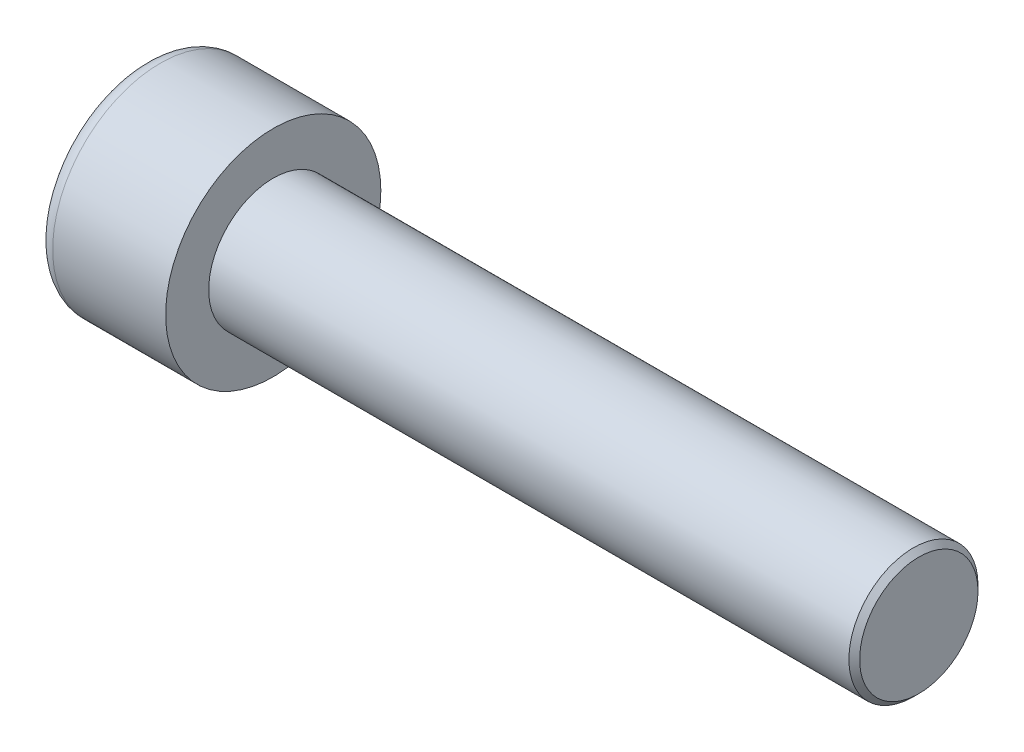
ISO-10303-21;
HEADER;
FILE_DESCRIPTION(('STEP AP214'),'2;1');
FILE_NAME('part.step','',(''),(''),'','','');
FILE_SCHEMA(('AUTOMOTIVE_DESIGN { 1 0 10303 214 1 1 1 1 }'));
ENDSEC;
DATA;
#1=APPLICATION_CONTEXT('core data for automotive mechanical design processes');
#2=APPLICATION_PROTOCOL_DEFINITION('international standard','automotive_design',2000,#1);
#3=PRODUCT_CONTEXT('',#1,'mechanical');
#4=PRODUCT('Part','Part','',(#3));
#5=PRODUCT_RELATED_PRODUCT_CATEGORY('part','',(#4));
#6=PRODUCT_DEFINITION_FORMATION('','',#4);
#7=PRODUCT_DEFINITION_CONTEXT('part definition',#1,'design');
#8=PRODUCT_DEFINITION('design','',#6,#7);
#9=PRODUCT_DEFINITION_SHAPE('','',#8);
#10=(LENGTH_UNIT() NAMED_UNIT(*) SI_UNIT(.MILLI.,.METRE.));
#11=(NAMED_UNIT(*) PLANE_ANGLE_UNIT() SI_UNIT($,.RADIAN.));
#12=(NAMED_UNIT(*) SI_UNIT($,.STERADIAN.) SOLID_ANGLE_UNIT());
#13=UNCERTAINTY_MEASURE_WITH_UNIT(LENGTH_MEASURE(1.E-05),#10,'distance_accuracy_value','');
#14=(GEOMETRIC_REPRESENTATION_CONTEXT(3) GLOBAL_UNCERTAINTY_ASSIGNED_CONTEXT((#13)) GLOBAL_UNIT_ASSIGNED_CONTEXT((#10,
#11,#12)) REPRESENTATION_CONTEXT('',''));
#15=CARTESIAN_POINT('',(0.,0.,0.));
#16=DIRECTION('',(0.,0.,1.));
#17=DIRECTION('',(1.,0.,0.));
#18=AXIS2_PLACEMENT_3D('',#15,#16,#17);
#19=CARTESIAN_POINT('',(3.,0.,-2.88675134594813));
#20=DIRECTION('',(1.,0.,0.));
#21=DIRECTION('',(0.,0.,-1.));
#22=AXIS2_PLACEMENT_3D('',#19,#20,#21);
#23=PLANE('',#22);
#24=CARTESIAN_POINT('',(3.,0.,0.));
#25=DIRECTION('',(1.,0.,0.));
#26=DIRECTION('',(0.,0.,-1.));
#27=AXIS2_PLACEMENT_3D('',#24,#25,#26);
#28=CIRCLE('',#27,2.5);
#29=CARTESIAN_POINT('',(3.,-1.25,-2.1650635094611));
#30=VERTEX_POINT('',#29);
#31=CARTESIAN_POINT('',(3.,-2.5,0.));
#32=VERTEX_POINT('',#31);
#33=EDGE_CURVE('E160',#30,#32,#28,.F.);
#34=ORIENTED_EDGE('',*,*,#33,.F.);
#35=DIRECTION('',(0.,0.866025403784439,-0.5));
#36=VECTOR('',#35,1.);
#37=CARTESIAN_POINT('',(3.,-2.5,-1.44337567297407));
#38=LINE('',#37,#36);
#39=CARTESIAN_POINT('',(3.,-2.5,-1.44337567297407));
#40=VERTEX_POINT('',#39);
#41=EDGE_CURVE('E168',#40,#30,#38,.T.);
#42=ORIENTED_EDGE('',*,*,#41,.F.);
#43=DIRECTION('',(0.,0.,-1.));
#44=VECTOR('',#43,1.);
#45=CARTESIAN_POINT('',(3.,-2.5,1.44337567297406));
#46=LINE('',#45,#44);
#47=EDGE_CURVE('E185',#32,#40,#46,.T.);
#48=ORIENTED_EDGE('',*,*,#47,.F.);
#49=EDGE_LOOP('',(#34,#42,#48));
#50=FACE_BOUND('',#49,.T.);
#51=ADVANCED_FACE('F37',(#50),#23,.F.);
#52=CARTESIAN_POINT('',(3.,-1.25,2.1650635094611));
#53=VERTEX_POINT('',#52);
#54=EDGE_CURVE('E290',#32,#53,#28,.F.);
#55=ORIENTED_EDGE('',*,*,#54,.F.);
#56=CARTESIAN_POINT('',(3.,-2.5,1.44337567297406));
#57=VERTEX_POINT('',#56);
#58=EDGE_CURVE('E186',#57,#32,#46,.T.);
#59=ORIENTED_EDGE('',*,*,#58,.F.);
#60=DIRECTION('',(0.,-0.866025403784439,-0.5));
#61=VECTOR('',#60,1.);
#62=CARTESIAN_POINT('',(3.,0.,2.88675134594813));
#63=LINE('',#62,#61);
#64=EDGE_CURVE('E181',#53,#57,#63,.T.);
#65=ORIENTED_EDGE('',*,*,#64,.F.);
#66=EDGE_LOOP('',(#55,#59,#65));
#67=FACE_BOUND('',#66,.T.);
#68=ADVANCED_FACE('F126',(#67),#23,.F.);
#69=CARTESIAN_POINT('',(3.,1.25,2.1650635094611));
#70=VERTEX_POINT('',#69);
#71=EDGE_CURVE('E286',#53,#70,#28,.F.);
#72=ORIENTED_EDGE('',*,*,#71,.F.);
#73=CARTESIAN_POINT('',(3.,0.,2.88675134594813));
#74=VERTEX_POINT('',#73);
#75=EDGE_CURVE('E182',#74,#53,#63,.T.);
#76=ORIENTED_EDGE('',*,*,#75,.F.);
#77=DIRECTION('',(0.,-0.866025403784439,0.5));
#78=VECTOR('',#77,1.);
#79=CARTESIAN_POINT('',(3.,2.5,1.44337567297406));
#80=LINE('',#79,#78);
#81=EDGE_CURVE('E177',#70,#74,#80,.T.);
#82=ORIENTED_EDGE('',*,*,#81,.F.);
#83=EDGE_LOOP('',(#72,#76,#82));
#84=FACE_BOUND('',#83,.T.);
#85=ADVANCED_FACE('F132',(#84),#23,.F.);
#86=CARTESIAN_POINT('',(3.,2.5,0.));
#87=VERTEX_POINT('',#86);
#88=EDGE_CURVE('E157',#70,#87,#28,.F.);
#89=ORIENTED_EDGE('',*,*,#88,.F.);
#90=CARTESIAN_POINT('',(3.,2.5,1.44337567297406));
#91=VERTEX_POINT('',#90);
#92=EDGE_CURVE('E178',#91,#70,#80,.T.);
#93=ORIENTED_EDGE('',*,*,#92,.F.);
#94=DIRECTION('',(0.,0.,1.));
#95=VECTOR('',#94,1.);
#96=CARTESIAN_POINT('',(3.,2.5,-1.44337567297407));
#97=LINE('',#96,#95);
#98=EDGE_CURVE('E172',#87,#91,#97,.T.);
#99=ORIENTED_EDGE('',*,*,#98,.F.);
#100=EDGE_LOOP('',(#89,#93,#99));
#101=FACE_BOUND('',#100,.T.);
#102=ADVANCED_FACE('F146',(#101),#23,.F.);
#103=CARTESIAN_POINT('',(3.,0.,0.));
#104=DIRECTION('',(1.,0.,0.));
#105=DIRECTION('',(0.,0.,-1.));
#106=AXIS2_PLACEMENT_3D('',#103,#104,#105);
#107=CIRCLE('',#106,2.5);
#108=CARTESIAN_POINT('',(3.,1.25,-2.1650635094611));
#109=VERTEX_POINT('',#108);
#110=EDGE_CURVE('E52',#109,#87,#107,.T.);
#111=ORIENTED_EDGE('',*,*,#110,.T.);
#112=CARTESIAN_POINT('',(3.,2.5,-1.44337567297407));
#113=VERTEX_POINT('',#112);
#114=EDGE_CURVE('E165',#113,#87,#97,.T.);
#115=ORIENTED_EDGE('',*,*,#114,.F.);
#116=DIRECTION('',(0.,0.866025403784438,0.5));
#117=VECTOR('',#116,1.);
#118=CARTESIAN_POINT('',(3.,0.,-2.88675134594813));
#119=LINE('',#118,#117);
#120=EDGE_CURVE('E162',#109,#113,#119,.T.);
#121=ORIENTED_EDGE('',*,*,#120,.F.);
#122=EDGE_LOOP('',(#111,#115,#121));
#123=FACE_BOUND('',#122,.T.);
#124=ADVANCED_FACE('F137',(#123),#23,.F.);
#125=EDGE_CURVE('E150',#109,#30,#28,.F.);
#126=ORIENTED_EDGE('',*,*,#125,.F.);
#127=CARTESIAN_POINT('',(3.,0.,-2.88675134594813));
#128=VERTEX_POINT('',#127);
#129=EDGE_CURVE('E153',#128,#109,#119,.T.);
#130=ORIENTED_EDGE('',*,*,#129,.F.);
#131=EDGE_CURVE('E155',#30,#128,#38,.T.);
#132=ORIENTED_EDGE('',*,*,#131,.F.);
#133=EDGE_LOOP('',(#126,#130,#132));
#134=FACE_BOUND('',#133,.T.);
#135=ADVANCED_FACE('F128',(#134),#23,.F.);
#136=CARTESIAN_POINT('',(0.,0.,0.));
#137=DIRECTION('',(1.,0.,0.));
#138=DIRECTION('',(0.,0.,-1.));
#139=AXIS2_PLACEMENT_3D('',#136,#137,#138);
#140=PLANE('',#139);
#141=CARTESIAN_POINT('',(0.,0.,0.));
#142=DIRECTION('',(1.,0.,0.));
#143=DIRECTION('',(0.,0.,-1.));
#144=AXIS2_PLACEMENT_3D('',#141,#142,#143);
#145=CIRCLE('',#144,4.25);
#146=CARTESIAN_POINT('',(0.,0.,-4.25));
#147=VERTEX_POINT('',#146);
#148=EDGE_CURVE('E225',#147,#147,#145,.F.);
#149=ORIENTED_EDGE('',*,*,#148,.T.);
#150=EDGE_LOOP('',(#149));
#151=FACE_BOUND('',#150,.T.);
#152=DIRECTION('',(0.,0.866025403784439,-0.5));
#153=VECTOR('',#152,1.);
#154=CARTESIAN_POINT('',(0.,-2.5,-1.44337567297407));
#155=LINE('',#154,#153);
#156=CARTESIAN_POINT('',(0.,-2.5,-1.44337567297407));
#157=VERTEX_POINT('',#156);
#158=CARTESIAN_POINT('',(0.,0.,-2.88675134594813));
#159=VERTEX_POINT('',#158);
#160=EDGE_CURVE('E60',#157,#159,#155,.T.);
#161=ORIENTED_EDGE('',*,*,#160,.T.);
#162=DIRECTION('',(0.,0.866025403784438,0.5));
#163=VECTOR('',#162,1.);
#164=CARTESIAN_POINT('',(0.,0.,-2.88675134594813));
#165=LINE('',#164,#163);
#166=CARTESIAN_POINT('',(0.,2.5,-1.44337567297407));
#167=VERTEX_POINT('',#166);
#168=EDGE_CURVE('E191',#159,#167,#165,.T.);
#169=ORIENTED_EDGE('',*,*,#168,.T.);
#170=DIRECTION('',(0.,0.,1.));
#171=VECTOR('',#170,1.);
#172=CARTESIAN_POINT('',(0.,2.5,-1.44337567297407));
#173=LINE('',#172,#171);
#174=CARTESIAN_POINT('',(0.,2.5,1.44337567297406));
#175=VERTEX_POINT('',#174);
#176=EDGE_CURVE('E194',#167,#175,#173,.T.);
#177=ORIENTED_EDGE('',*,*,#176,.T.);
#178=DIRECTION('',(0.,-0.866025403784439,0.5));
#179=VECTOR('',#178,1.);
#180=CARTESIAN_POINT('',(0.,2.5,1.44337567297406));
#181=LINE('',#180,#179);
#182=CARTESIAN_POINT('',(0.,0.,2.88675134594813));
#183=VERTEX_POINT('',#182);
#184=EDGE_CURVE('E197',#175,#183,#181,.T.);
#185=ORIENTED_EDGE('',*,*,#184,.T.);
#186=DIRECTION('',(0.,-0.866025403784439,-0.5));
#187=VECTOR('',#186,1.);
#188=CARTESIAN_POINT('',(0.,0.,2.88675134594813));
#189=LINE('',#188,#187);
#190=CARTESIAN_POINT('',(0.,-2.5,1.44337567297406));
#191=VERTEX_POINT('',#190);
#192=EDGE_CURVE('E200',#183,#191,#189,.T.);
#193=ORIENTED_EDGE('',*,*,#192,.T.);
#194=DIRECTION('',(0.,0.,-1.));
#195=VECTOR('',#194,1.);
#196=CARTESIAN_POINT('',(0.,-2.5,1.44337567297406));
#197=LINE('',#196,#195);
#198=EDGE_CURVE('E203',#191,#157,#197,.T.);
#199=ORIENTED_EDGE('',*,*,#198,.T.);
#200=EDGE_LOOP('',(#161,#169,#177,#185,#193,#199));
#201=FACE_BOUND('',#200,.T.);
#202=ADVANCED_FACE('F136',(#151,#201),#140,.F.);
#203=CARTESIAN_POINT('',(6.,0.,0.));
#204=DIRECTION('',(1.,0.,0.));
#205=DIRECTION('',(0.,0.,-1.));
#206=AXIS2_PLACEMENT_3D('',#203,#204,#205);
#207=PLANE('',#206);
#208=CARTESIAN_POINT('',(6.,0.,0.));
#209=DIRECTION('',(1.,0.,0.));
#210=DIRECTION('',(0.,0.,-1.));
#211=AXIS2_PLACEMENT_3D('',#208,#209,#210);
#212=CIRCLE('',#211,5.);
#213=CARTESIAN_POINT('',(6.,0.,-5.));
#214=VERTEX_POINT('',#213);
#215=EDGE_CURVE('E158',#214,#214,#212,.T.);
#216=ORIENTED_EDGE('',*,*,#215,.T.);
#217=EDGE_LOOP('',(#216));
#218=FACE_BOUND('',#217,.T.);
#219=CARTESIAN_POINT('',(6.,0.,0.));
#220=DIRECTION('',(1.,0.,0.));
#221=DIRECTION('',(0.,0.,-1.));
#222=AXIS2_PLACEMENT_3D('',#219,#220,#221);
#223=CIRCLE('',#222,3.);
#224=CARTESIAN_POINT('',(6.,0.,-3.));
#225=VERTEX_POINT('',#224);
#226=EDGE_CURVE('E216',#225,#225,#223,.T.);
#227=ORIENTED_EDGE('',*,*,#226,.F.);
#228=EDGE_LOOP('',(#227));
#229=FACE_BOUND('',#228,.T.);
#230=ADVANCED_FACE('F143',(#218,#229),#207,.T.);
#231=CARTESIAN_POINT('',(6.,0.,0.));
#232=DIRECTION('',(-1.,0.,0.));
#233=DIRECTION('',(0.,0.,1.));
#234=AXIS2_PLACEMENT_3D('',#231,#232,#233);
#235=CYLINDRICAL_SURFACE('',#234,5.);
#236=CARTESIAN_POINT('',(0.75,0.,0.));
#237=DIRECTION('',(1.,0.,0.));
#238=DIRECTION('',(0.,0.,-1.));
#239=AXIS2_PLACEMENT_3D('',#236,#237,#238);
#240=CIRCLE('',#239,5.);
#241=CARTESIAN_POINT('',(0.75,0.,-5.));
#242=VERTEX_POINT('',#241);
#243=EDGE_CURVE('E222',#242,#242,#240,.T.);
#244=ORIENTED_EDGE('',*,*,#243,.T.);
#245=EDGE_LOOP('',(#244));
#246=FACE_BOUND('',#245,.T.);
#247=ORIENTED_EDGE('',*,*,#215,.F.);
#248=EDGE_LOOP('',(#247));
#249=FACE_BOUND('',#248,.T.);
#250=ADVANCED_FACE('F241',(#246,#249),#235,.T.);
#251=CARTESIAN_POINT('',(36.,0.,0.));
#252=DIRECTION('',(-1.,0.,0.));
#253=DIRECTION('',(0.,0.,1.));
#254=AXIS2_PLACEMENT_3D('',#251,#252,#253);
#255=CYLINDRICAL_SURFACE('',#254,3.);
#256=CARTESIAN_POINT('',(35.75,0.,0.));
#257=DIRECTION('',(1.,0.,0.));
#258=DIRECTION('',(0.,0.,-1.));
#259=AXIS2_PLACEMENT_3D('',#256,#257,#258);
#260=CIRCLE('',#259,3.);
#261=CARTESIAN_POINT('',(35.75,0.,-3.));
#262=VERTEX_POINT('',#261);
#263=EDGE_CURVE('E11',#262,#262,#260,.F.);
#264=ORIENTED_EDGE('',*,*,#263,.T.);
#265=EDGE_LOOP('',(#264));
#266=FACE_BOUND('',#265,.T.);
#267=ORIENTED_EDGE('',*,*,#226,.T.);
#268=EDGE_LOOP('',(#267));
#269=FACE_BOUND('',#268,.T.);
#270=ADVANCED_FACE('F238',(#266,#269),#255,.T.);
#271=CARTESIAN_POINT('',(36.,0.,0.));
#272=DIRECTION('',(1.,0.,0.));
#273=DIRECTION('',(0.,0.,-1.));
#274=AXIS2_PLACEMENT_3D('',#271,#272,#273);
#275=PLANE('',#274);
#276=CARTESIAN_POINT('',(36.,0.,0.));
#277=DIRECTION('',(1.,0.,0.));
#278=DIRECTION('',(0.,0.,-1.));
#279=AXIS2_PLACEMENT_3D('',#276,#277,#278);
#280=CIRCLE('',#279,2.75);
#281=CARTESIAN_POINT('',(36.,0.,-2.75));
#282=VERTEX_POINT('',#281);
#283=EDGE_CURVE('E45',#282,#282,#280,.T.);
#284=ORIENTED_EDGE('',*,*,#283,.T.);
#285=EDGE_LOOP('',(#284));
#286=FACE_BOUND('',#285,.T.);
#287=ADVANCED_FACE('F230',(#286),#275,.T.);
#288=CARTESIAN_POINT('',(3.,-2.5,-1.44337567297407));
#289=DIRECTION('',(0.,0.5,0.866025403784438));
#290=DIRECTION('',(0.,-0.866025403784439,0.5));
#291=AXIS2_PLACEMENT_3D('',#288,#289,#290);
#292=PLANE('',#291);
#293=ORIENTED_EDGE('',*,*,#160,.F.);
#294=DIRECTION('',(-1.,0.,0.));
#295=VECTOR('',#294,1.);
#296=CARTESIAN_POINT('',(3.,-2.5,-1.44337567297407));
#297=LINE('',#296,#295);
#298=EDGE_CURVE('E189',#40,#157,#297,.T.);
#299=ORIENTED_EDGE('',*,*,#298,.F.);
#300=ORIENTED_EDGE('',*,*,#41,.T.);
#301=ORIENTED_EDGE('',*,*,#131,.T.);
#302=DIRECTION('',(-1.,0.,0.));
#303=VECTOR('',#302,1.);
#304=CARTESIAN_POINT('',(3.,0.,-2.88675134594813));
#305=LINE('',#304,#303);
#306=EDGE_CURVE('E171',#128,#159,#305,.T.);
#307=ORIENTED_EDGE('',*,*,#306,.T.);
#308=EDGE_LOOP('',(#293,#299,#300,#301,#307));
#309=FACE_BOUND('',#308,.T.);
#310=ADVANCED_FACE('F256',(#309),#292,.T.);
#311=CARTESIAN_POINT('',(3.,0.,-2.88675134594813));
#312=DIRECTION('',(0.,-0.5,0.866025403784438));
#313=DIRECTION('',(0.,-0.866025403784438,-0.5));
#314=AXIS2_PLACEMENT_3D('',#311,#312,#313);
#315=PLANE('',#314);
#316=ORIENTED_EDGE('',*,*,#168,.F.);
#317=ORIENTED_EDGE('',*,*,#306,.F.);
#318=ORIENTED_EDGE('',*,*,#129,.T.);
#319=ORIENTED_EDGE('',*,*,#120,.T.);
#320=DIRECTION('',(-1.,0.,0.));
#321=VECTOR('',#320,1.);
#322=CARTESIAN_POINT('',(3.,2.5,-1.44337567297407));
#323=LINE('',#322,#321);
#324=EDGE_CURVE('E213',#113,#167,#323,.T.);
#325=ORIENTED_EDGE('',*,*,#324,.T.);
#326=EDGE_LOOP('',(#316,#317,#318,#319,#325));
#327=FACE_BOUND('',#326,.T.);
#328=ADVANCED_FACE('F170',(#327),#315,.T.);
#329=CARTESIAN_POINT('',(3.,2.5,-1.44337567297407));
#330=DIRECTION('',(0.,-1.,0.));
#331=DIRECTION('',(0.,0.,-1.));
#332=AXIS2_PLACEMENT_3D('',#329,#330,#331);
#333=PLANE('',#332);
#334=ORIENTED_EDGE('',*,*,#176,.F.);
#335=ORIENTED_EDGE('',*,*,#324,.F.);
#336=ORIENTED_EDGE('',*,*,#114,.T.);
#337=ORIENTED_EDGE('',*,*,#98,.T.);
#338=DIRECTION('',(-1.,0.,0.));
#339=VECTOR('',#338,1.);
#340=CARTESIAN_POINT('',(3.,2.5,1.44337567297406));
#341=LINE('',#340,#339);
#342=EDGE_CURVE('E211',#91,#175,#341,.T.);
#343=ORIENTED_EDGE('',*,*,#342,.T.);
#344=EDGE_LOOP('',(#334,#335,#336,#337,#343));
#345=FACE_BOUND('',#344,.T.);
#346=ADVANCED_FACE('F261',(#345),#333,.T.);
#347=CARTESIAN_POINT('',(3.,2.5,1.44337567297406));
#348=DIRECTION('',(0.,-0.5,-0.866025403784439));
#349=DIRECTION('',(0.,0.866025403784439,-0.5));
#350=AXIS2_PLACEMENT_3D('',#347,#348,#349);
#351=PLANE('',#350);
#352=ORIENTED_EDGE('',*,*,#184,.F.);
#353=ORIENTED_EDGE('',*,*,#342,.F.);
#354=ORIENTED_EDGE('',*,*,#92,.T.);
#355=ORIENTED_EDGE('',*,*,#81,.T.);
#356=DIRECTION('',(-1.,0.,0.));
#357=VECTOR('',#356,1.);
#358=CARTESIAN_POINT('',(3.,0.,2.88675134594813));
#359=LINE('',#358,#357);
#360=EDGE_CURVE('E209',#74,#183,#359,.T.);
#361=ORIENTED_EDGE('',*,*,#360,.T.);
#362=EDGE_LOOP('',(#352,#353,#354,#355,#361));
#363=FACE_BOUND('',#362,.T.);
#364=ADVANCED_FACE('F264',(#363),#351,.T.);
#365=CARTESIAN_POINT('',(3.,0.,2.88675134594813));
#366=DIRECTION('',(0.,0.5,-0.866025403784438));
#367=DIRECTION('',(0.,0.866025403784439,0.5));
#368=AXIS2_PLACEMENT_3D('',#365,#366,#367);
#369=PLANE('',#368);
#370=ORIENTED_EDGE('',*,*,#192,.F.);
#371=ORIENTED_EDGE('',*,*,#360,.F.);
#372=ORIENTED_EDGE('',*,*,#75,.T.);
#373=ORIENTED_EDGE('',*,*,#64,.T.);
#374=DIRECTION('',(-1.,0.,0.));
#375=VECTOR('',#374,1.);
#376=CARTESIAN_POINT('',(3.,-2.5,1.44337567297406));
#377=LINE('',#376,#375);
#378=EDGE_CURVE('E207',#57,#191,#377,.T.);
#379=ORIENTED_EDGE('',*,*,#378,.T.);
#380=EDGE_LOOP('',(#370,#371,#372,#373,#379));
#381=FACE_BOUND('',#380,.T.);
#382=ADVANCED_FACE('F121',(#381),#369,.T.);
#383=CARTESIAN_POINT('',(3.,-2.5,1.44337567297406));
#384=DIRECTION('',(0.,1.,0.));
#385=DIRECTION('',(0.,0.,1.));
#386=AXIS2_PLACEMENT_3D('',#383,#384,#385);
#387=PLANE('',#386);
#388=ORIENTED_EDGE('',*,*,#198,.F.);
#389=ORIENTED_EDGE('',*,*,#378,.F.);
#390=ORIENTED_EDGE('',*,*,#58,.T.);
#391=ORIENTED_EDGE('',*,*,#47,.T.);
#392=ORIENTED_EDGE('',*,*,#298,.T.);
#393=EDGE_LOOP('',(#388,#389,#390,#391,#392));
#394=FACE_BOUND('',#393,.T.);
#395=ADVANCED_FACE('F114',(#394),#387,.T.);
#396=CARTESIAN_POINT('',(3.,0.,0.));
#397=DIRECTION('',(-1.,0.,0.));
#398=DIRECTION('',(0.,0.,1.));
#399=AXIS2_PLACEMENT_3D('',#396,#397,#398);
#400=CONICAL_SURFACE('',#399,2.5,1.04719755119659);
#401=CARTESIAN_POINT('',(4.44337567297408,0.,0.));
#402=VERTEX_POINT('',#401);
#403=VERTEX_LOOP('',#402);
#404=FACE_BOUND('',#403,.T.);
#405=ORIENTED_EDGE('',*,*,#110,.F.);
#406=ORIENTED_EDGE('',*,*,#125,.T.);
#407=ORIENTED_EDGE('',*,*,#33,.T.);
#408=ORIENTED_EDGE('',*,*,#54,.T.);
#409=ORIENTED_EDGE('',*,*,#71,.T.);
#410=ORIENTED_EDGE('',*,*,#88,.T.);
#411=EDGE_LOOP('',(#405,#406,#407,#408,#409,#410));
#412=FACE_BOUND('',#411,.T.);
#413=ADVANCED_FACE('F111',(#404,#412),#400,.F.);
#414=CARTESIAN_POINT('',(0.75,0.,0.));
#415=DIRECTION('',(1.,0.,0.));
#416=DIRECTION('',(0.,0.,-1.));
#417=AXIS2_PLACEMENT_3D('',#414,#415,#416);
#418=TOROIDAL_SURFACE('',#417,4.25,0.75);
#419=ORIENTED_EDGE('',*,*,#148,.F.);
#420=EDGE_LOOP('',(#419));
#421=FACE_BOUND('',#420,.T.);
#422=ORIENTED_EDGE('',*,*,#243,.F.);
#423=EDGE_LOOP('',(#422));
#424=FACE_BOUND('',#423,.T.);
#425=ADVANCED_FACE('F113',(#421,#424),#418,.T.);
#426=CARTESIAN_POINT('',(36.,0.,0.));
#427=DIRECTION('',(-1.,0.,0.));
#428=DIRECTION('',(0.,0.,1.));
#429=AXIS2_PLACEMENT_3D('',#426,#427,#428);
#430=CONICAL_SURFACE('',#429,2.75,0.785398163397451);
#431=ORIENTED_EDGE('',*,*,#263,.F.);
#432=EDGE_LOOP('',(#431));
#433=FACE_BOUND('',#432,.T.);
#434=ORIENTED_EDGE('',*,*,#283,.F.);
#435=EDGE_LOOP('',(#434));
#436=FACE_BOUND('',#435,.T.);
#437=ADVANCED_FACE('F39',(#433,#436),#430,.T.);
#438=CLOSED_SHELL('',(#51,#68,#85,#102,#124,#135,#202,#230,#250,#270,#287,#310,#328,#346,#364,
#382,#395,#413,#425,#437));
#439=MANIFOLD_SOLID_BREP('B2',#438);
#440=ADVANCED_BREP_SHAPE_REPRESENTATION('',(#18,#439),#14);
#441=SHAPE_DEFINITION_REPRESENTATION(#9,#440);
ENDSEC;
END-ISO-10303-21;
